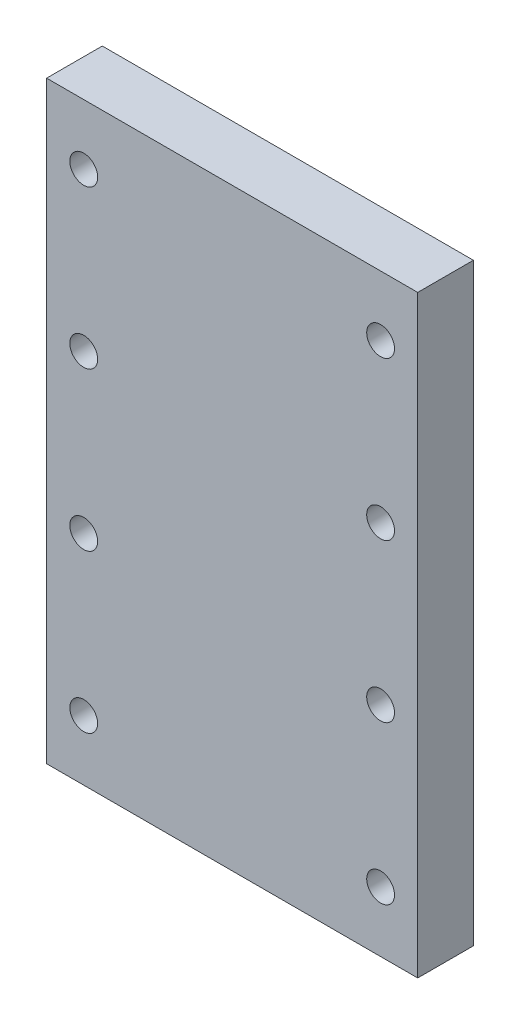
ISO-10303-21;
HEADER;
FILE_DESCRIPTION(('STEP AP214'),'2;1');
FILE_NAME('part.step','',(''),(''),'','','');
FILE_SCHEMA(('AUTOMOTIVE_DESIGN { 1 0 10303 214 1 1 1 1 }'));
ENDSEC;
DATA;
#1=APPLICATION_CONTEXT('core data for automotive mechanical design processes');
#2=APPLICATION_PROTOCOL_DEFINITION('international standard','automotive_design',2000,#1);
#3=PRODUCT_CONTEXT('',#1,'mechanical');
#4=PRODUCT('Part','Part','',(#3));
#5=PRODUCT_RELATED_PRODUCT_CATEGORY('part','',(#4));
#6=PRODUCT_DEFINITION_FORMATION('','',#4);
#7=PRODUCT_DEFINITION_CONTEXT('part definition',#1,'design');
#8=PRODUCT_DEFINITION('design','',#6,#7);
#9=PRODUCT_DEFINITION_SHAPE('','',#8);
#10=(LENGTH_UNIT() NAMED_UNIT(*) SI_UNIT(.MILLI.,.METRE.));
#11=(NAMED_UNIT(*) PLANE_ANGLE_UNIT() SI_UNIT($,.RADIAN.));
#12=(NAMED_UNIT(*) SI_UNIT($,.STERADIAN.) SOLID_ANGLE_UNIT());
#13=UNCERTAINTY_MEASURE_WITH_UNIT(LENGTH_MEASURE(1.E-05),#10,'distance_accuracy_value','');
#14=(GEOMETRIC_REPRESENTATION_CONTEXT(3) GLOBAL_UNCERTAINTY_ASSIGNED_CONTEXT((#13)) GLOBAL_UNIT_ASSIGNED_CONTEXT((#10,
#11,#12)) REPRESENTATION_CONTEXT('',''));
#15=CARTESIAN_POINT('',(0.,0.,0.));
#16=DIRECTION('',(0.,0.,1.));
#17=DIRECTION('',(1.,0.,0.));
#18=AXIS2_PLACEMENT_3D('',#15,#16,#17);
#19=CARTESIAN_POINT('',(-32.8888888888889,3.55555555555554,6.));
#20=DIRECTION('',(1.,0.,0.));
#21=DIRECTION('',(0.,0.,-1.));
#22=AXIS2_PLACEMENT_3D('',#19,#20,#21);
#23=PLANE('',#22);
#24=DIRECTION('',(0.,-1.,0.));
#25=VECTOR('',#24,1.);
#26=CARTESIAN_POINT('',(-32.8888888888889,3.55555555555554,0.));
#27=LINE('',#26,#25);
#28=CARTESIAN_POINT('',(-32.8888888888889,67.5555555555555,0.));
#29=VERTEX_POINT('',#28);
#30=CARTESIAN_POINT('',(-32.8888888888889,3.55555555555554,0.));
#31=VERTEX_POINT('',#30);
#32=EDGE_CURVE('E131',#29,#31,#27,.T.);
#33=ORIENTED_EDGE('',*,*,#32,.T.);
#34=DIRECTION('',(0.,0.,-1.));
#35=VECTOR('',#34,1.);
#36=CARTESIAN_POINT('',(-32.8888888888889,3.55555555555554,6.));
#37=LINE('',#36,#35);
#38=CARTESIAN_POINT('',(-32.8888888888889,3.55555555555554,6.));
#39=VERTEX_POINT('',#38);
#40=EDGE_CURVE('E12',#39,#31,#37,.T.);
#41=ORIENTED_EDGE('',*,*,#40,.F.);
#42=DIRECTION('',(0.,-1.,0.));
#43=VECTOR('',#42,1.);
#44=CARTESIAN_POINT('',(-32.8888888888889,3.55555555555554,6.));
#45=LINE('',#44,#43);
#46=CARTESIAN_POINT('',(-32.8888888888889,67.5555555555555,6.));
#47=VERTEX_POINT('',#46);
#48=EDGE_CURVE('E115',#47,#39,#45,.T.);
#49=ORIENTED_EDGE('',*,*,#48,.F.);
#50=DIRECTION('',(0.,0.,-1.));
#51=VECTOR('',#50,1.);
#52=CARTESIAN_POINT('',(-32.8888888888889,67.5555555555555,6.));
#53=LINE('',#52,#51);
#54=EDGE_CURVE('E127',#47,#29,#53,.T.);
#55=ORIENTED_EDGE('',*,*,#54,.T.);
#56=EDGE_LOOP('',(#33,#41,#49,#55));
#57=FACE_BOUND('',#56,.T.);
#58=ADVANCED_FACE('F63',(#57),#23,.F.);
#59=CARTESIAN_POINT('',(-32.8888888888889,3.55555555555554,6.));
#60=DIRECTION('',(0.,1.,0.));
#61=DIRECTION('',(0.,0.,1.));
#62=AXIS2_PLACEMENT_3D('',#59,#60,#61);
#63=PLANE('',#62);
#64=DIRECTION('',(1.,0.,0.));
#65=VECTOR('',#64,1.);
#66=CARTESIAN_POINT('',(-32.8888888888889,3.55555555555554,0.));
#67=LINE('',#66,#65);
#68=CARTESIAN_POINT('',(7.11111111111114,3.55555555555554,0.));
#69=VERTEX_POINT('',#68);
#70=EDGE_CURVE('E120',#31,#69,#67,.T.);
#71=ORIENTED_EDGE('',*,*,#70,.T.);
#72=DIRECTION('',(0.,0.,-1.));
#73=VECTOR('',#72,1.);
#74=CARTESIAN_POINT('',(7.11111111111114,3.55555555555554,6.));
#75=LINE('',#74,#73);
#76=CARTESIAN_POINT('',(7.11111111111114,3.55555555555554,6.));
#77=VERTEX_POINT('',#76);
#78=EDGE_CURVE('E72',#77,#69,#75,.T.);
#79=ORIENTED_EDGE('',*,*,#78,.F.);
#80=DIRECTION('',(1.,0.,0.));
#81=VECTOR('',#80,1.);
#82=CARTESIAN_POINT('',(-32.8888888888889,3.55555555555554,6.));
#83=LINE('',#82,#81);
#84=EDGE_CURVE('E110',#39,#77,#83,.T.);
#85=ORIENTED_EDGE('',*,*,#84,.F.);
#86=ORIENTED_EDGE('',*,*,#40,.T.);
#87=EDGE_LOOP('',(#71,#79,#85,#86));
#88=FACE_BOUND('',#87,.T.);
#89=ADVANCED_FACE('F119',(#88),#63,.F.);
#90=CARTESIAN_POINT('',(7.11111111111114,3.55555555555554,6.));
#91=DIRECTION('',(-1.,0.,0.));
#92=DIRECTION('',(0.,0.,1.));
#93=AXIS2_PLACEMENT_3D('',#90,#91,#92);
#94=PLANE('',#93);
#95=DIRECTION('',(0.,1.,0.));
#96=VECTOR('',#95,1.);
#97=CARTESIAN_POINT('',(7.11111111111114,3.55555555555554,0.));
#98=LINE('',#97,#96);
#99=CARTESIAN_POINT('',(7.11111111111114,67.5555555555555,0.));
#100=VERTEX_POINT('',#99);
#101=EDGE_CURVE('E97',#69,#100,#98,.T.);
#102=ORIENTED_EDGE('',*,*,#101,.T.);
#103=DIRECTION('',(0.,0.,-1.));
#104=VECTOR('',#103,1.);
#105=CARTESIAN_POINT('',(7.11111111111114,67.5555555555555,6.));
#106=LINE('',#105,#104);
#107=CARTESIAN_POINT('',(7.11111111111114,67.5555555555555,6.));
#108=VERTEX_POINT('',#107);
#109=EDGE_CURVE('E122',#108,#100,#106,.T.);
#110=ORIENTED_EDGE('',*,*,#109,.F.);
#111=DIRECTION('',(0.,1.,0.));
#112=VECTOR('',#111,1.);
#113=CARTESIAN_POINT('',(7.11111111111114,3.55555555555554,6.));
#114=LINE('',#113,#112);
#115=EDGE_CURVE('E113',#77,#108,#114,.T.);
#116=ORIENTED_EDGE('',*,*,#115,.F.);
#117=ORIENTED_EDGE('',*,*,#78,.T.);
#118=EDGE_LOOP('',(#102,#110,#116,#117));
#119=FACE_BOUND('',#118,.T.);
#120=ADVANCED_FACE('F123',(#119),#94,.F.);
#121=CARTESIAN_POINT('',(-32.8888888888889,67.5555555555555,6.));
#122=DIRECTION('',(0.,-1.,0.));
#123=DIRECTION('',(0.,0.,-1.));
#124=AXIS2_PLACEMENT_3D('',#121,#122,#123);
#125=PLANE('',#124);
#126=DIRECTION('',(-1.,0.,0.));
#127=VECTOR('',#126,1.);
#128=CARTESIAN_POINT('',(-32.8888888888889,67.5555555555555,0.));
#129=LINE('',#128,#127);
#130=EDGE_CURVE('E103',#100,#29,#129,.T.);
#131=ORIENTED_EDGE('',*,*,#130,.T.);
#132=ORIENTED_EDGE('',*,*,#54,.F.);
#133=DIRECTION('',(-1.,0.,0.));
#134=VECTOR('',#133,1.);
#135=CARTESIAN_POINT('',(-32.8888888888889,67.5555555555555,6.));
#136=LINE('',#135,#134);
#137=EDGE_CURVE('E80',#108,#47,#136,.T.);
#138=ORIENTED_EDGE('',*,*,#137,.F.);
#139=ORIENTED_EDGE('',*,*,#109,.T.);
#140=EDGE_LOOP('',(#131,#132,#138,#139));
#141=FACE_BOUND('',#140,.T.);
#142=ADVANCED_FACE('F145',(#141),#125,.F.);
#143=CARTESIAN_POINT('',(0.,0.,6.));
#144=DIRECTION('',(0.,0.,-1.));
#145=DIRECTION('',(-1.,0.,0.));
#146=AXIS2_PLACEMENT_3D('',#143,#144,#145);
#147=PLANE('',#146);
#148=CARTESIAN_POINT('',(-28.8888888888889,10.0555555555555,6.));
#149=DIRECTION('',(0.,0.,-1.));
#150=DIRECTION('',(-1.,0.,0.));
#151=AXIS2_PLACEMENT_3D('',#148,#149,#150);
#152=CIRCLE('',#151,1.5);
#153=CARTESIAN_POINT('',(-30.3888888888889,10.0555555555555,6.));
#154=VERTEX_POINT('',#153);
#155=EDGE_CURVE('E135',#154,#154,#152,.T.);
#156=ORIENTED_EDGE('',*,*,#155,.T.);
#157=EDGE_LOOP('',(#156));
#158=FACE_BOUND('',#157,.T.);
#159=CARTESIAN_POINT('',(-28.8888888888889,44.0555555555556,6.));
#160=DIRECTION('',(0.,0.,-1.));
#161=DIRECTION('',(-1.,0.,0.));
#162=AXIS2_PLACEMENT_3D('',#159,#160,#161);
#163=CIRCLE('',#162,1.5);
#164=CARTESIAN_POINT('',(-30.3888888888889,44.0555555555556,6.));
#165=VERTEX_POINT('',#164);
#166=EDGE_CURVE('E155',#165,#165,#163,.T.);
#167=ORIENTED_EDGE('',*,*,#166,.T.);
#168=EDGE_LOOP('',(#167));
#169=FACE_BOUND('',#168,.T.);
#170=CARTESIAN_POINT('',(-28.8888888888889,27.0555555555555,6.));
#171=DIRECTION('',(0.,0.,-1.));
#172=DIRECTION('',(-1.,0.,0.));
#173=AXIS2_PLACEMENT_3D('',#170,#171,#172);
#174=CIRCLE('',#173,1.5);
#175=CARTESIAN_POINT('',(-30.3888888888889,27.0555555555555,6.));
#176=VERTEX_POINT('',#175);
#177=EDGE_CURVE('E159',#176,#176,#174,.T.);
#178=ORIENTED_EDGE('',*,*,#177,.T.);
#179=EDGE_LOOP('',(#178));
#180=FACE_BOUND('',#179,.T.);
#181=CARTESIAN_POINT('',(3.11111111111114,10.0555555555555,6.));
#182=DIRECTION('',(0.,0.,-1.));
#183=DIRECTION('',(-1.,0.,0.));
#184=AXIS2_PLACEMENT_3D('',#181,#182,#183);
#185=CIRCLE('',#184,1.5);
#186=CARTESIAN_POINT('',(1.61111111111114,10.0555555555555,6.));
#187=VERTEX_POINT('',#186);
#188=EDGE_CURVE('E163',#187,#187,#185,.T.);
#189=ORIENTED_EDGE('',*,*,#188,.T.);
#190=EDGE_LOOP('',(#189));
#191=FACE_BOUND('',#190,.T.);
#192=CARTESIAN_POINT('',(3.11111111111114,27.0555555555555,6.));
#193=DIRECTION('',(0.,0.,-1.));
#194=DIRECTION('',(-1.,0.,0.));
#195=AXIS2_PLACEMENT_3D('',#192,#193,#194);
#196=CIRCLE('',#195,1.5);
#197=CARTESIAN_POINT('',(1.61111111111114,27.0555555555555,6.));
#198=VERTEX_POINT('',#197);
#199=EDGE_CURVE('E167',#198,#198,#196,.T.);
#200=ORIENTED_EDGE('',*,*,#199,.T.);
#201=EDGE_LOOP('',(#200));
#202=FACE_BOUND('',#201,.T.);
#203=CARTESIAN_POINT('',(3.11111111111114,44.0555555555556,6.));
#204=DIRECTION('',(0.,0.,-1.));
#205=DIRECTION('',(-1.,0.,0.));
#206=AXIS2_PLACEMENT_3D('',#203,#204,#205);
#207=CIRCLE('',#206,1.5);
#208=CARTESIAN_POINT('',(1.61111111111114,44.0555555555556,6.));
#209=VERTEX_POINT('',#208);
#210=EDGE_CURVE('E171',#209,#209,#207,.T.);
#211=ORIENTED_EDGE('',*,*,#210,.T.);
#212=EDGE_LOOP('',(#211));
#213=FACE_BOUND('',#212,.T.);
#214=CARTESIAN_POINT('',(3.11111111111114,61.0555555555556,6.));
#215=DIRECTION('',(0.,0.,-1.));
#216=DIRECTION('',(-1.,0.,0.));
#217=AXIS2_PLACEMENT_3D('',#214,#215,#216);
#218=CIRCLE('',#217,1.5);
#219=CARTESIAN_POINT('',(1.61111111111114,61.0555555555556,6.));
#220=VERTEX_POINT('',#219);
#221=EDGE_CURVE('E175',#220,#220,#218,.T.);
#222=ORIENTED_EDGE('',*,*,#221,.T.);
#223=EDGE_LOOP('',(#222));
#224=FACE_BOUND('',#223,.T.);
#225=CARTESIAN_POINT('',(-28.8888888888889,61.0555555555556,6.));
#226=DIRECTION('',(0.,0.,-1.));
#227=DIRECTION('',(-1.,0.,0.));
#228=AXIS2_PLACEMENT_3D('',#225,#226,#227);
#229=CIRCLE('',#228,1.5);
#230=CARTESIAN_POINT('',(-30.3888888888889,61.0555555555556,6.));
#231=VERTEX_POINT('',#230);
#232=EDGE_CURVE('E179',#231,#231,#229,.T.);
#233=ORIENTED_EDGE('',*,*,#232,.T.);
#234=EDGE_LOOP('',(#233));
#235=FACE_BOUND('',#234,.T.);
#236=ORIENTED_EDGE('',*,*,#48,.T.);
#237=ORIENTED_EDGE('',*,*,#84,.T.);
#238=ORIENTED_EDGE('',*,*,#115,.T.);
#239=ORIENTED_EDGE('',*,*,#137,.T.);
#240=EDGE_LOOP('',(#236,#237,#238,#239));
#241=FACE_BOUND('',#240,.T.);
#242=ADVANCED_FACE('F111',(#158,#169,#180,#191,#202,#213,#224,#235,#241),#147,.F.);
#243=CARTESIAN_POINT('',(0.,0.,0.));
#244=DIRECTION('',(0.,0.,-1.));
#245=DIRECTION('',(-1.,0.,0.));
#246=AXIS2_PLACEMENT_3D('',#243,#244,#245);
#247=PLANE('',#246);
#248=CARTESIAN_POINT('',(-28.8888888888889,10.0555555555555,0.));
#249=DIRECTION('',(0.,0.,1.));
#250=DIRECTION('',(1.,0.,0.));
#251=AXIS2_PLACEMENT_3D('',#248,#249,#250);
#252=CIRCLE('',#251,1.5);
#253=CARTESIAN_POINT('',(-27.3888888888889,10.0555555555555,0.));
#254=VERTEX_POINT('',#253);
#255=EDGE_CURVE('E192',#254,#254,#252,.T.);
#256=ORIENTED_EDGE('',*,*,#255,.T.);
#257=EDGE_LOOP('',(#256));
#258=FACE_BOUND('',#257,.T.);
#259=CARTESIAN_POINT('',(-28.8888888888889,44.0555555555556,0.));
#260=DIRECTION('',(0.,0.,1.));
#261=DIRECTION('',(1.,0.,0.));
#262=AXIS2_PLACEMENT_3D('',#259,#260,#261);
#263=CIRCLE('',#262,1.5);
#264=CARTESIAN_POINT('',(-27.3888888888889,44.0555555555556,0.));
#265=VERTEX_POINT('',#264);
#266=EDGE_CURVE('E188',#265,#265,#263,.T.);
#267=ORIENTED_EDGE('',*,*,#266,.T.);
#268=EDGE_LOOP('',(#267));
#269=FACE_BOUND('',#268,.T.);
#270=CARTESIAN_POINT('',(-28.8888888888889,27.0555555555555,0.));
#271=DIRECTION('',(0.,0.,1.));
#272=DIRECTION('',(1.,0.,0.));
#273=AXIS2_PLACEMENT_3D('',#270,#271,#272);
#274=CIRCLE('',#273,1.5);
#275=CARTESIAN_POINT('',(-27.3888888888889,27.0555555555555,0.));
#276=VERTEX_POINT('',#275);
#277=EDGE_CURVE('E193',#276,#276,#274,.T.);
#278=ORIENTED_EDGE('',*,*,#277,.T.);
#279=EDGE_LOOP('',(#278));
#280=FACE_BOUND('',#279,.T.);
#281=CARTESIAN_POINT('',(3.11111111111114,10.0555555555555,0.));
#282=DIRECTION('',(0.,0.,1.));
#283=DIRECTION('',(1.,0.,0.));
#284=AXIS2_PLACEMENT_3D('',#281,#282,#283);
#285=CIRCLE('',#284,1.5);
#286=CARTESIAN_POINT('',(4.61111111111114,10.0555555555555,0.));
#287=VERTEX_POINT('',#286);
#288=EDGE_CURVE('E197',#287,#287,#285,.T.);
#289=ORIENTED_EDGE('',*,*,#288,.T.);
#290=EDGE_LOOP('',(#289));
#291=FACE_BOUND('',#290,.T.);
#292=CARTESIAN_POINT('',(3.11111111111114,27.0555555555555,0.));
#293=DIRECTION('',(0.,0.,1.));
#294=DIRECTION('',(1.,0.,0.));
#295=AXIS2_PLACEMENT_3D('',#292,#293,#294);
#296=CIRCLE('',#295,1.5);
#297=CARTESIAN_POINT('',(4.61111111111114,27.0555555555555,0.));
#298=VERTEX_POINT('',#297);
#299=EDGE_CURVE('E204',#298,#298,#296,.T.);
#300=ORIENTED_EDGE('',*,*,#299,.T.);
#301=EDGE_LOOP('',(#300));
#302=FACE_BOUND('',#301,.T.);
#303=CARTESIAN_POINT('',(3.11111111111114,44.0555555555556,0.));
#304=DIRECTION('',(0.,0.,1.));
#305=DIRECTION('',(1.,0.,0.));
#306=AXIS2_PLACEMENT_3D('',#303,#304,#305);
#307=CIRCLE('',#306,1.5);
#308=CARTESIAN_POINT('',(4.61111111111114,44.0555555555556,0.));
#309=VERTEX_POINT('',#308);
#310=EDGE_CURVE('E208',#309,#309,#307,.T.);
#311=ORIENTED_EDGE('',*,*,#310,.T.);
#312=EDGE_LOOP('',(#311));
#313=FACE_BOUND('',#312,.T.);
#314=CARTESIAN_POINT('',(3.11111111111114,61.0555555555556,0.));
#315=DIRECTION('',(0.,0.,1.));
#316=DIRECTION('',(1.,0.,0.));
#317=AXIS2_PLACEMENT_3D('',#314,#315,#316);
#318=CIRCLE('',#317,1.5);
#319=CARTESIAN_POINT('',(4.61111111111114,61.0555555555556,0.));
#320=VERTEX_POINT('',#319);
#321=EDGE_CURVE('E187',#320,#320,#318,.T.);
#322=ORIENTED_EDGE('',*,*,#321,.T.);
#323=EDGE_LOOP('',(#322));
#324=FACE_BOUND('',#323,.T.);
#325=CARTESIAN_POINT('',(-28.8888888888889,61.0555555555556,0.));
#326=DIRECTION('',(0.,0.,1.));
#327=DIRECTION('',(1.,0.,0.));
#328=AXIS2_PLACEMENT_3D('',#325,#326,#327);
#329=CIRCLE('',#328,1.5);
#330=CARTESIAN_POINT('',(-27.3888888888889,61.0555555555556,0.));
#331=VERTEX_POINT('',#330);
#332=EDGE_CURVE('E183',#331,#331,#329,.T.);
#333=ORIENTED_EDGE('',*,*,#332,.T.);
#334=EDGE_LOOP('',(#333));
#335=FACE_BOUND('',#334,.T.);
#336=ORIENTED_EDGE('',*,*,#32,.F.);
#337=ORIENTED_EDGE('',*,*,#130,.F.);
#338=ORIENTED_EDGE('',*,*,#101,.F.);
#339=ORIENTED_EDGE('',*,*,#70,.F.);
#340=EDGE_LOOP('',(#336,#337,#338,#339));
#341=FACE_BOUND('',#340,.T.);
#342=ADVANCED_FACE('F148',(#258,#269,#280,#291,#302,#313,#324,#335,#341),#247,.T.);
#343=CARTESIAN_POINT('',(-28.8888888888889,61.0555555555556,0.));
#344=DIRECTION('',(0.,0.,1.));
#345=DIRECTION('',(1.,0.,0.));
#346=AXIS2_PLACEMENT_3D('',#343,#344,#345);
#347=CYLINDRICAL_SURFACE('',#346,1.5);
#348=ORIENTED_EDGE('',*,*,#332,.F.);
#349=EDGE_LOOP('',(#348));
#350=FACE_BOUND('',#349,.T.);
#351=ORIENTED_EDGE('',*,*,#232,.F.);
#352=EDGE_LOOP('',(#351));
#353=FACE_BOUND('',#352,.T.);
#354=ADVANCED_FACE('F222',(#350,#353),#347,.F.);
#355=CARTESIAN_POINT('',(3.11111111111114,61.0555555555556,0.));
#356=DIRECTION('',(0.,0.,1.));
#357=DIRECTION('',(1.,0.,0.));
#358=AXIS2_PLACEMENT_3D('',#355,#356,#357);
#359=CYLINDRICAL_SURFACE('',#358,1.5);
#360=ORIENTED_EDGE('',*,*,#321,.F.);
#361=EDGE_LOOP('',(#360));
#362=FACE_BOUND('',#361,.T.);
#363=ORIENTED_EDGE('',*,*,#221,.F.);
#364=EDGE_LOOP('',(#363));
#365=FACE_BOUND('',#364,.T.);
#366=ADVANCED_FACE('F218',(#362,#365),#359,.F.);
#367=CARTESIAN_POINT('',(3.11111111111114,44.0555555555556,0.));
#368=DIRECTION('',(0.,0.,1.));
#369=DIRECTION('',(1.,0.,0.));
#370=AXIS2_PLACEMENT_3D('',#367,#368,#369);
#371=CYLINDRICAL_SURFACE('',#370,1.5);
#372=ORIENTED_EDGE('',*,*,#310,.F.);
#373=EDGE_LOOP('',(#372));
#374=FACE_BOUND('',#373,.T.);
#375=ORIENTED_EDGE('',*,*,#210,.F.);
#376=EDGE_LOOP('',(#375));
#377=FACE_BOUND('',#376,.T.);
#378=ADVANCED_FACE('F221',(#374,#377),#371,.F.);
#379=CARTESIAN_POINT('',(3.11111111111114,27.0555555555555,0.));
#380=DIRECTION('',(0.,0.,1.));
#381=DIRECTION('',(1.,0.,0.));
#382=AXIS2_PLACEMENT_3D('',#379,#380,#381);
#383=CYLINDRICAL_SURFACE('',#382,1.5);
#384=ORIENTED_EDGE('',*,*,#299,.F.);
#385=EDGE_LOOP('',(#384));
#386=FACE_BOUND('',#385,.T.);
#387=ORIENTED_EDGE('',*,*,#199,.F.);
#388=EDGE_LOOP('',(#387));
#389=FACE_BOUND('',#388,.T.);
#390=ADVANCED_FACE('F286',(#386,#389),#383,.F.);
#391=CARTESIAN_POINT('',(3.11111111111114,10.0555555555555,0.));
#392=DIRECTION('',(0.,0.,1.));
#393=DIRECTION('',(1.,0.,0.));
#394=AXIS2_PLACEMENT_3D('',#391,#392,#393);
#395=CYLINDRICAL_SURFACE('',#394,1.5);
#396=ORIENTED_EDGE('',*,*,#288,.F.);
#397=EDGE_LOOP('',(#396));
#398=FACE_BOUND('',#397,.T.);
#399=ORIENTED_EDGE('',*,*,#188,.F.);
#400=EDGE_LOOP('',(#399));
#401=FACE_BOUND('',#400,.T.);
#402=ADVANCED_FACE('F296',(#398,#401),#395,.F.);
#403=CARTESIAN_POINT('',(-28.8888888888889,27.0555555555555,0.));
#404=DIRECTION('',(0.,0.,1.));
#405=DIRECTION('',(1.,0.,0.));
#406=AXIS2_PLACEMENT_3D('',#403,#404,#405);
#407=CYLINDRICAL_SURFACE('',#406,1.5);
#408=ORIENTED_EDGE('',*,*,#277,.F.);
#409=EDGE_LOOP('',(#408));
#410=FACE_BOUND('',#409,.T.);
#411=ORIENTED_EDGE('',*,*,#177,.F.);
#412=EDGE_LOOP('',(#411));
#413=FACE_BOUND('',#412,.T.);
#414=ADVANCED_FACE('F306',(#410,#413),#407,.F.);
#415=CARTESIAN_POINT('',(-28.8888888888889,44.0555555555556,0.));
#416=DIRECTION('',(0.,0.,1.));
#417=DIRECTION('',(1.,0.,0.));
#418=AXIS2_PLACEMENT_3D('',#415,#416,#417);
#419=CYLINDRICAL_SURFACE('',#418,1.5);
#420=ORIENTED_EDGE('',*,*,#266,.F.);
#421=EDGE_LOOP('',(#420));
#422=FACE_BOUND('',#421,.T.);
#423=ORIENTED_EDGE('',*,*,#166,.F.);
#424=EDGE_LOOP('',(#423));
#425=FACE_BOUND('',#424,.T.);
#426=ADVANCED_FACE('F316',(#422,#425),#419,.F.);
#427=CARTESIAN_POINT('',(-28.8888888888889,10.0555555555555,0.));
#428=DIRECTION('',(0.,0.,1.));
#429=DIRECTION('',(1.,0.,0.));
#430=AXIS2_PLACEMENT_3D('',#427,#428,#429);
#431=CYLINDRICAL_SURFACE('',#430,1.5);
#432=ORIENTED_EDGE('',*,*,#255,.F.);
#433=EDGE_LOOP('',(#432));
#434=FACE_BOUND('',#433,.T.);
#435=ORIENTED_EDGE('',*,*,#155,.F.);
#436=EDGE_LOOP('',(#435));
#437=FACE_BOUND('',#436,.T.);
#438=ADVANCED_FACE('F329',(#434,#437),#431,.F.);
#439=CLOSED_SHELL('',(#58,#89,#120,#142,#242,#342,#354,#366,#378,#390,#402,#414,#426,#438));
#440=MANIFOLD_SOLID_BREP('B2',#439);
#441=ADVANCED_BREP_SHAPE_REPRESENTATION('',(#18,#440),#14);
#442=SHAPE_DEFINITION_REPRESENTATION(#9,#441);
ENDSEC;
END-ISO-10303-21;
